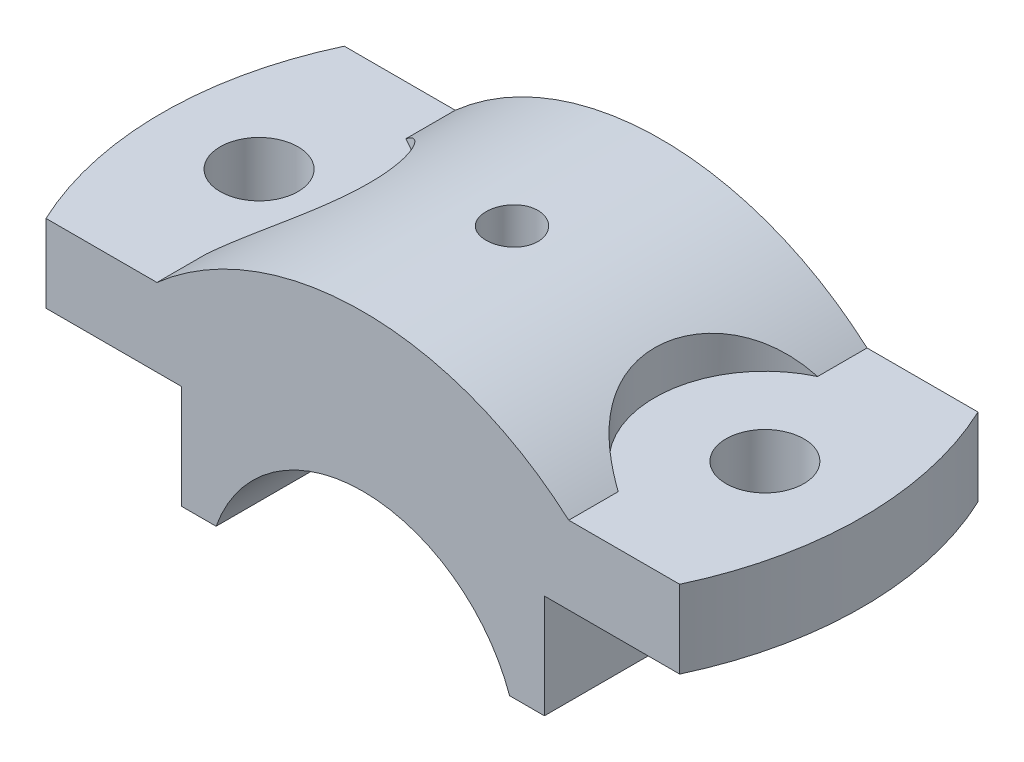
ISO-10303-21;
HEADER;
FILE_DESCRIPTION(('STEP AP214'),'2;1');
FILE_NAME('part.step','',(''),(''),'','','');
FILE_SCHEMA(('AUTOMOTIVE_DESIGN { 1 0 10303 214 1 1 1 1 }'));
ENDSEC;
DATA;
#1=APPLICATION_CONTEXT('core data for automotive mechanical design processes');
#2=APPLICATION_PROTOCOL_DEFINITION('international standard','automotive_design',2000,#1);
#3=PRODUCT_CONTEXT('',#1,'mechanical');
#4=PRODUCT('Part','Part','',(#3));
#5=PRODUCT_RELATED_PRODUCT_CATEGORY('part','',(#4));
#6=PRODUCT_DEFINITION_FORMATION('','',#4);
#7=PRODUCT_DEFINITION_CONTEXT('part definition',#1,'design');
#8=PRODUCT_DEFINITION('design','',#6,#7);
#9=PRODUCT_DEFINITION_SHAPE('','',#8);
#10=(LENGTH_UNIT() NAMED_UNIT(*) SI_UNIT(.MILLI.,.METRE.));
#11=(NAMED_UNIT(*) PLANE_ANGLE_UNIT() SI_UNIT($,.RADIAN.));
#12=(NAMED_UNIT(*) SI_UNIT($,.STERADIAN.) SOLID_ANGLE_UNIT());
#13=UNCERTAINTY_MEASURE_WITH_UNIT(LENGTH_MEASURE(1.E-05),#10,'distance_accuracy_value','');
#14=(GEOMETRIC_REPRESENTATION_CONTEXT(3) GLOBAL_UNCERTAINTY_ASSIGNED_CONTEXT((#13)) GLOBAL_UNIT_ASSIGNED_CONTEXT((#10,
#11,#12)) REPRESENTATION_CONTEXT('',''));
#15=CARTESIAN_POINT('',(0.,0.,0.));
#16=DIRECTION('',(0.,0.,1.));
#17=DIRECTION('',(1.,0.,0.));
#18=AXIS2_PLACEMENT_3D('',#15,#16,#17);
#19=CARTESIAN_POINT('',(0.,0.,23.));
#20=DIRECTION('',(0.,0.,-1.));
#21=DIRECTION('',(-1.,0.,0.));
#22=AXIS2_PLACEMENT_3D('',#19,#20,#21);
#23=CYLINDRICAL_SURFACE('',#22,48.);
#24=CARTESIAN_POINT('',(0.,48.,4.));
#25=CARTESIAN_POINT('',(-0.224264359684817,47.9999978164606,3.99999020469488));
#26=CARTESIAN_POINT('',(-0.448681388720903,47.9984115417359,3.98107612075582));
#27=CARTESIAN_POINT('',(-0.891306282801559,47.99223609313,3.90590259257969));
#28=CARTESIAN_POINT('',(-1.10950682090092,47.9876435172678,3.84960083878039));
#29=CARTESIAN_POINT('',(-1.53322409005704,47.9759744498441,3.70129138476253));
#30=CARTESIAN_POINT('',(-1.73874792169846,47.9688993639394,3.60930388756073));
#31=CARTESIAN_POINT('',(-2.13138893366431,47.9530587097885,3.39227027251202));
#32=CARTESIAN_POINT('',(-2.31851003954155,47.9442935032543,3.26723122608997));
#33=CARTESIAN_POINT('',(-2.66955999986236,47.9260311946685,2.98729973357602));
#34=CARTESIAN_POINT('',(-2.83343548966464,47.916532483463,2.83234046425726));
#35=CARTESIAN_POINT('',(-3.13288453414622,47.8978872321267,2.49710841660027));
#36=CARTESIAN_POINT('',(-3.26845684548602,47.8887407074816,2.31683452678951));
#37=CARTESIAN_POINT('',(-3.50763168956091,47.8718181064497,1.93576753160389));
#38=CARTESIAN_POINT('',(-3.61118733180617,47.8640440472037,1.73494489838891));
#39=CARTESIAN_POINT('',(-3.78308973509538,47.8507649779309,1.31868681777607));
#40=CARTESIAN_POINT('',(-3.85143711804967,47.8452599278253,1.103251628567));
#41=CARTESIAN_POINT('',(-3.95082811927428,47.8371556826529,0.66441843247529));
#42=CARTESIAN_POINT('',(-3.9819586615591,47.8345497174488,0.441040240029592));
#43=CARTESIAN_POINT('',(-4.00630083206171,47.832517292859,-0.00778481578146269));
#44=CARTESIAN_POINT('',(-3.99951317191816,47.8330907738024,-0.23323164024401));
#45=CARTESIAN_POINT('',(-3.94828345685939,47.8373462944655,-0.679198662042085));
#46=CARTESIAN_POINT('',(-3.90393587215223,47.8410205351141,-0.89972979630565));
#47=CARTESIAN_POINT('',(-3.77899194153176,47.8510513427746,-1.33020746957181));
#48=CARTESIAN_POINT('',(-3.69839524158714,47.857407935984,-1.54015390517541));
#49=CARTESIAN_POINT('',(-3.50313515260813,47.8720961882741,-1.94380362351239));
#50=CARTESIAN_POINT('',(-3.38842937902877,47.8804303020385,-2.13748631035003));
#51=CARTESIAN_POINT('',(-3.12823777565339,47.8981322745552,-2.50288535527922));
#52=CARTESIAN_POINT('',(-2.98275132249017,47.9075001542412,-2.67460126838886));
#53=CARTESIAN_POINT('',(-2.66459832890545,47.9262488164658,-2.99174167712626));
#54=CARTESIAN_POINT('',(-2.4918501175623,47.9356295510026,-3.13708425651701));
#55=CARTESIAN_POINT('',(-2.124362225487,47.9533196747934,-3.39671889355421));
#56=CARTESIAN_POINT('',(-1.92962253006135,47.9616290633314,-3.51101093045423));
#57=CARTESIAN_POINT('',(-1.5236263730714,47.9762418323856,-3.70529505067482));
#58=CARTESIAN_POINT('',(-1.3123681672363,47.9825450006977,-3.78528350591262));
#59=CARTESIAN_POINT('',(-0.879356276078327,47.9924326964719,-3.90863252980531));
#60=CARTESIAN_POINT('',(-0.65760280867542,47.9960172803554,-3.95199385862105));
#61=CARTESIAN_POINT('',(-0.210605200657004,48.000056677722,-4.00075505616631));
#62=CARTESIAN_POINT('',(0.0146265164607834,48.0005208196801,-4.00626807242759));
#63=CARTESIAN_POINT('',(0.462811010013213,47.998291951148,-3.97947255749074));
#64=CARTESIAN_POINT('',(0.685763807685652,47.995598970107,-3.94716437908216));
#65=CARTESIAN_POINT('',(1.1227390248988,47.9873647136528,-3.84573736555962));
#66=CARTESIAN_POINT('',(1.33677370055889,47.9818274966968,-3.77667097589676));
#67=CARTESIAN_POINT('',(1.75021666032996,47.968526804494,-3.60374164887188));
#68=CARTESIAN_POINT('',(1.94962471313253,47.9607632940497,-3.499878161366));
#69=CARTESIAN_POINT('',(2.32866887320763,47.9438570557453,-3.26001860313458));
#70=CARTESIAN_POINT('',(2.50825740208588,47.9347111287495,-3.12394757442069));
#71=CARTESIAN_POINT('',(2.84208437937448,47.9160783455879,-2.82364377179807));
#72=CARTESIAN_POINT('',(2.99632238725753,47.9065914835011,-2.65941050860293));
#73=CARTESIAN_POINT('',(3.27545818182041,47.8883184486329,-2.30695323120664));
#74=CARTESIAN_POINT('',(3.40028213293455,47.8795340749689,-2.1186706352104));
#75=CARTESIAN_POINT('',(3.61654025135807,47.8636860697728,-1.72375094854634));
#76=CARTESIAN_POINT('',(3.70797475203985,47.8566224210606,-1.51711404116025));
#77=CARTESIAN_POINT('',(3.85473270976226,47.8450257139576,-1.09161283784305));
#78=CARTESIAN_POINT('',(3.91010136579716,47.8404894891454,-0.872764221142678));
#79=CARTESIAN_POINT('',(3.98330307964061,47.834450627634,-0.428837200502305));
#80=CARTESIAN_POINT('',(4.00113685827306,47.8329479326787,-0.203758916281622));
#81=CARTESIAN_POINT('',(3.99875425156372,47.8331471180078,0.245504504083582));
#82=CARTESIAN_POINT('',(3.97865387910956,47.8348392277228,0.469690268945752));
#83=CARTESIAN_POINT('',(3.90121545318012,47.8412166032922,0.911490134203405));
#84=CARTESIAN_POINT('',(3.84387734291051,47.8459018737118,1.12910422457536));
#85=CARTESIAN_POINT('',(3.69362044006825,47.8577350852682,1.55159105306647));
#86=CARTESIAN_POINT('',(3.60070373602613,47.8648828818476,1.75646453826275));
#87=CARTESIAN_POINT('',(3.381940235789,47.8808359950028,2.14772336229467));
#88=CARTESIAN_POINT('',(3.25609395645823,47.8896412855619,2.3341089912533));
#89=CARTESIAN_POINT('',(2.97460776848979,47.9079492679472,2.68369495605204));
#90=CARTESIAN_POINT('',(2.81888197496583,47.9174539202297,2.84682603462939));
#91=CARTESIAN_POINT('',(2.48221290236986,47.9360718003871,3.14470074081328));
#92=CARTESIAN_POINT('',(2.30126353056437,47.945184932993,3.27943748998406));
#93=CARTESIAN_POINT('',(1.91893509211766,47.962009393691,3.51687944167025));
#94=CARTESIAN_POINT('',(1.71751862508215,47.9697180809242,3.61952455462531));
#95=CARTESIAN_POINT('',(1.30038300798293,47.982834100652,3.78940721220511));
#96=CARTESIAN_POINT('',(1.0846806216546,47.9882440771302,3.85668545715242));
#97=CARTESIAN_POINT('',(0.723088192386717,47.994764309354,3.93679033000819));
#98=CARTESIAN_POINT('',(0.579523577753882,47.9967187550781,3.96046245006995));
#99=CARTESIAN_POINT('',(0.290660686004649,47.9993373063453,3.99207043870882));
#100=CARTESIAN_POINT('',(0.14536241349218,48.0000014153143,4.00000634906587));
#101=CARTESIAN_POINT('',(0.,48.,4.));
#102=B_SPLINE_CURVE_WITH_KNOTS('',3,(#24,#25,#26,#27,#28,#29,#30,#31,#32,#33,#34,#35,#36,#37,
#38,#39,#40,#41,#42,#43,#44,#45,#46,#47,#48,#49,#50,#51,#52,#53,#54,#55,#56,#57,#58,#59,#60,#61,
#62,#63,#64,#65,#66,#67,#68,#69,#70,#71,#72,#73,#74,#75,#76,#77,#78,#79,#80,#81,#82,#83,#84,#85,
#86,#87,#88,#89,#90,#91,#92,#93,#94,#95,#96,#97,#98,#99,#100,#101),.UNSPECIFIED.,.T.,.F.,(4,2,2,
2,2,2,2,2,2,2,2,2,2,2,2,2,2,2,2,2,2,2,2,2,2,2,2,2,2,2,2,2,2,2,2,2,2,2,4),(0.,0.672262347200556,
1.34528675599134,2.01793069555582,2.69043083833672,3.36445067514306,4.03850011495726,
4.71353211804365,5.38855219711603,6.06199259326345,6.73542035050475,7.40715932441158,
8.07890485907995,8.75148862995597,9.42408602323441,10.098738037406,10.7733905023458,
11.448114303618,12.1228241013014,12.7955159722867,13.4682015685688,14.1399299612314,
14.8116689744549,15.4849869989971,16.15831672285,16.8333190596481,17.5083146567931,
18.1824626896371,18.8565977759503,19.5286745153011,20.2007522796936,20.8727905979009,
21.5448183683942,22.2188075465856,22.8929598092992,23.5683669225022,24.2429950636714,
24.6787394542665,25.1144826879498),.UNSPECIFIED.);
#103=CARTESIAN_POINT('',(0.,48.,4.));
#104=VERTEX_POINT('',#103);
#105=EDGE_CURVE('E11',#104,#104,#102,.T.);
#106=ORIENTED_EDGE('',*,*,#105,.T.);
#107=EDGE_LOOP('',(#106));
#108=FACE_BOUND('',#107,.T.);
#109=DIRECTION('',(0.,0.,-1.));
#110=VECTOR('',#109,1.);
#111=CARTESIAN_POINT('',(-31.7490157327748,36.0000000000003,23.));
#112=LINE('',#111,#110);
#113=CARTESIAN_POINT('',(-31.7490157327748,36.0000000000003,-15.3760601961769));
#114=VERTEX_POINT('',#113);
#115=CARTESIAN_POINT('',(-31.7490157327751,36.,-23.));
#116=VERTEX_POINT('',#115);
#117=EDGE_CURVE('E150',#114,#116,#112,.T.);
#118=ORIENTED_EDGE('',*,*,#117,.F.);
#119=CARTESIAN_POINT('',(-31.7490157327751,36.,-15.3760601961769));
#120=CARTESIAN_POINT('',(-31.5666993606048,36.1607910344816,-15.2900831270757));
#121=CARTESIAN_POINT('',(-31.3842407385663,36.3192382806886,-15.200076432177));
#122=CARTESIAN_POINT('',(-31.0194382984914,36.6312986785064,-15.0117552307289));
#123=CARTESIAN_POINT('',(-30.8370944958099,36.7849112802083,-14.9134397837671));
#124=CARTESIAN_POINT('',(-30.2906545114744,37.2384242405059,-14.6055515958542));
#125=CARTESIAN_POINT('',(-29.9273932433292,37.5307855559239,-14.3831506648985));
#126=CARTESIAN_POINT('',(-29.2055877678829,38.0952057641667,-13.9017498917579));
#127=CARTESIAN_POINT('',(-28.8470773519233,38.3671527207169,-13.6425680163447));
#128=CARTESIAN_POINT('',(-28.1414563178619,38.8876660950044,-13.0879067788259));
#129=CARTESIAN_POINT('',(-27.7943424142725,39.1362392903486,-12.7924379963692));
#130=CARTESIAN_POINT('',(-27.1144372728569,39.6103537782901,-12.1634340928703));
#131=CARTESIAN_POINT('',(-26.7817440960143,39.8357484531289,-11.8296819039897));
#132=CARTESIAN_POINT('',(-26.1381758530123,40.2609560521935,-11.1265718110928));
#133=CARTESIAN_POINT('',(-25.8273031949563,40.4607661549158,-10.7572099878546));
#134=CARTESIAN_POINT('',(-25.2335249148575,40.8337098769773,-9.98600624775));
#135=CARTESIAN_POINT('',(-24.9505424988563,41.0069175240425,-9.58425938846312));
#136=CARTESIAN_POINT('',(-24.4165226257608,41.3271148139075,-8.75027197863381));
#137=CARTESIAN_POINT('',(-24.165480267083,41.4741084809499,-8.31803612285603));
#138=CARTESIAN_POINT('',(-23.7269538102758,41.7263466257883,-7.47873214327821));
#139=CARTESIAN_POINT('',(-23.535471816767,41.8344606926746,-7.07460691096143));
#140=CARTESIAN_POINT('',(-23.1835604410674,42.0305023424913,-6.24834535649117));
#141=CARTESIAN_POINT('',(-23.0231288276401,42.1184313759742,-5.82621033115845));
#142=CARTESIAN_POINT('',(-22.7354708993115,42.2744033380662,-4.9669406692712));
#143=CARTESIAN_POINT('',(-22.608263014144,42.3424352319097,-4.52979785912656));
#144=CARTESIAN_POINT('',(-22.3889311500727,42.4588178093571,-3.64423461983452));
#145=CARTESIAN_POINT('',(-22.2968060905276,42.5071690991774,-3.19581453850973));
#146=CARTESIAN_POINT('',(-22.1535573681311,42.5819913104556,-2.31986442510465));
#147=CARTESIAN_POINT('',(-22.1002179585565,42.6096478774008,-1.8927960452594));
#148=CARTESIAN_POINT('',(-22.0260840023336,42.6480173220226,-1.0351010084908));
#149=CARTESIAN_POINT('',(-22.0052877863416,42.6587310688026,-0.604474535223505));
#150=CARTESIAN_POINT('',(-21.9964874817101,42.6632694542849,0.257033751988564));
#151=CARTESIAN_POINT('',(-22.0084707600267,42.6571005994522,0.687915403597725));
#152=CARTESIAN_POINT('',(-22.065059537599,42.6278566152432,1.5469567479689));
#153=CARTESIAN_POINT('',(-22.1096651361626,42.6047814344012,1.97511643244078));
#154=CARTESIAN_POINT('',(-22.2301596888934,42.5420325739506,2.81994764060091));
#155=CARTESIAN_POINT('',(-22.3056259308811,42.5025830752487,3.23669621522389));
#156=CARTESIAN_POINT('',(-22.4869158657054,42.4069464217796,4.06157204983066));
#157=CARTESIAN_POINT('',(-22.5927390819871,42.3507595297616,4.46969944504493));
#158=CARTESIAN_POINT('',(-22.8334963082055,42.2214412118201,5.27452238868222));
#159=CARTESIAN_POINT('',(-22.968430619134,42.1483096106976,5.67121781885726));
#160=CARTESIAN_POINT('',(-23.2658059297839,41.9848905587104,6.45050946606148));
#161=CARTESIAN_POINT('',(-23.4282471429062,41.8946029747475,6.83310557367883));
#162=CARTESIAN_POINT('',(-23.7802108235912,41.6958360657888,7.58497168737197));
#163=CARTESIAN_POINT('',(-23.9699550727257,41.5872063549857,7.95409805630049));
#164=CARTESIAN_POINT('',(-24.3731485080022,41.3521952355227,8.67324372694056));
#165=CARTESIAN_POINT('',(-24.5865977528721,41.2258137828835,9.02326298131199));
#166=CARTESIAN_POINT('',(-25.0346129932482,40.9552998874379,9.70223622389593));
#167=CARTESIAN_POINT('',(-25.2691774101921,40.8111687712936,10.031191783681));
#168=CARTESIAN_POINT('',(-25.7566603032743,40.5052741270816,10.6665029899036));
#169=CARTESIAN_POINT('',(-26.0095789285025,40.3435104557808,10.9728584527217));
#170=CARTESIAN_POINT('',(-26.5418842805158,39.9954208539864,11.574253346598));
#171=CARTESIAN_POINT('',(-26.8219376643438,39.8083462352715,11.8682688661706));
#172=CARTESIAN_POINT('',(-27.3955194624364,39.4158125971757,12.42968690155));
#173=CARTESIAN_POINT('',(-27.6890490642933,39.2103519560056,12.6970870652738));
#174=CARTESIAN_POINT('',(-28.2863824379904,38.7816416595243,13.2050051767951));
#175=CARTESIAN_POINT('',(-28.5901897214681,38.5583858879776,13.4455138130625));
#176=CARTESIAN_POINT('',(-29.2047776474053,38.0950011657592,13.8996257253554));
#177=CARTESIAN_POINT('',(-29.515556781803,37.8548758405909,14.113234755093));
#178=CARTESIAN_POINT('',(-30.1465409740783,37.3543930550497,14.5175420543304));
#179=CARTESIAN_POINT('',(-30.4668164417767,37.0937608790559,14.7077886938376));
#180=CARTESIAN_POINT('',(-31.1079315091614,36.5577863535064,15.0615091701432));
#181=CARTESIAN_POINT('',(-31.4287665224091,36.282490555825,15.2250617322872));
#182=CARTESIAN_POINT('',(-31.7490157327751,36.,15.3760601961769));
#183=B_SPLINE_CURVE_WITH_KNOTS('',3,(#119,#120,#121,#122,#123,#124,#125,#126,#127,#128,#129,
#130,#131,#132,#133,#134,#135,#136,#137,#138,#139,#140,#141,#142,#143,#144,#145,#146,#147,#148,
#149,#150,#151,#152,#153,#154,#155,#156,#157,#158,#159,#160,#161,#162,#163,#164,#165,#166,#167,
#168,#169,#170,#171,#172,#173,#174,#175,#176,#177,#178,#179,#180,#181,#182),.UNSPECIFIED.,.F.,
.F.,(4,2,2,2,2,2,2,2,2,2,2,2,2,2,2,2,2,2,2,2,2,2,2,2,2,2,2,2,2,2,2,4),(0.,0.773458025682374,
1.5470037114875,3.09512332277502,4.65119082007947,6.20680570955183,7.77172305062613,
9.33681282467526,10.8974652129592,12.4578778108563,13.8363264835486,15.2146760660573,
16.5937886249588,17.9728587002061,19.2651269606078,20.5573289303254,21.8490329624021,
23.1407409266611,24.4153187748838,25.6898766154092,26.9644476347566,28.2390285427914,
29.5246179289053,30.8102105000725,32.0957070405173,33.381214024115,34.7209972321288,
36.060898736084,37.4012627703214,38.7413396176214,40.1042161588979,41.4629977344695),.UNSPECIFIED.);
#184=CARTESIAN_POINT('',(-31.7490157327751,36.,15.3760601961769));
#185=VERTEX_POINT('',#184);
#186=EDGE_CURVE('E142',#114,#185,#183,.T.);
#187=ORIENTED_EDGE('',*,*,#186,.T.);
#188=CARTESIAN_POINT('',(-31.7490157327748,36.0000000000003,23.));
#189=VERTEX_POINT('',#188);
#190=EDGE_CURVE('E147',#189,#185,#112,.T.);
#191=ORIENTED_EDGE('',*,*,#190,.F.);
#192=CARTESIAN_POINT('',(0.,0.,23.));
#193=DIRECTION('',(0.,0.,1.));
#194=DIRECTION('',(1.,0.,0.));
#195=AXIS2_PLACEMENT_3D('',#192,#193,#194);
#196=CIRCLE('',#195,48.);
#197=CARTESIAN_POINT('',(31.7490157327751,36.,23.));
#198=VERTEX_POINT('',#197);
#199=EDGE_CURVE('E500',#198,#189,#196,.T.);
#200=ORIENTED_EDGE('',*,*,#199,.F.);
#201=DIRECTION('',(0.,0.,-1.));
#202=VECTOR('',#201,1.);
#203=CARTESIAN_POINT('',(31.7490157327751,36.,23.));
#204=LINE('',#203,#202);
#205=CARTESIAN_POINT('',(31.7490157327751,36.,15.3760601961769));
#206=VERTEX_POINT('',#205);
#207=EDGE_CURVE('E158',#198,#206,#204,.T.);
#208=ORIENTED_EDGE('',*,*,#207,.T.);
#209=CARTESIAN_POINT('',(31.7490157327751,36.,-15.3760601961769));
#210=CARTESIAN_POINT('',(31.5666993606048,36.1607910344816,-15.2900831270757));
#211=CARTESIAN_POINT('',(31.3842407385663,36.3192382806886,-15.200076432177));
#212=CARTESIAN_POINT('',(31.0194382984914,36.6312986785064,-15.0117552307289));
#213=CARTESIAN_POINT('',(30.8370944958099,36.7849112802083,-14.9134397837671));
#214=CARTESIAN_POINT('',(30.2906545114744,37.2384242405059,-14.6055515958542));
#215=CARTESIAN_POINT('',(29.9273932433292,37.5307855559239,-14.3831506648985));
#216=CARTESIAN_POINT('',(29.2055877678829,38.0952057641667,-13.9017498917579));
#217=CARTESIAN_POINT('',(28.8470773519233,38.3671527207169,-13.6425680163447));
#218=CARTESIAN_POINT('',(28.1414563178619,38.8876660950044,-13.0879067788259));
#219=CARTESIAN_POINT('',(27.7943424142725,39.1362392903486,-12.7924379963692));
#220=CARTESIAN_POINT('',(27.1144372728569,39.6103537782901,-12.1634340928703));
#221=CARTESIAN_POINT('',(26.7817440960143,39.8357484531289,-11.8296819039897));
#222=CARTESIAN_POINT('',(26.1381758530123,40.2609560521935,-11.1265718110928));
#223=CARTESIAN_POINT('',(25.8273031949563,40.4607661549158,-10.7572099878546));
#224=CARTESIAN_POINT('',(25.2335249148575,40.8337098769773,-9.98600624775));
#225=CARTESIAN_POINT('',(24.9505424988563,41.0069175240425,-9.58425938846312));
#226=CARTESIAN_POINT('',(24.4165226257608,41.3271148139075,-8.75027197863381));
#227=CARTESIAN_POINT('',(24.165480267083,41.4741084809499,-8.31803612285603));
#228=CARTESIAN_POINT('',(23.7269538102758,41.7263466257883,-7.47873214327821));
#229=CARTESIAN_POINT('',(23.535471816767,41.8344606926746,-7.07460691096143));
#230=CARTESIAN_POINT('',(23.1835604410674,42.0305023424913,-6.24834535649117));
#231=CARTESIAN_POINT('',(23.0231288276401,42.1184313759742,-5.82621033115845));
#232=CARTESIAN_POINT('',(22.7354708993115,42.2744033380662,-4.9669406692712));
#233=CARTESIAN_POINT('',(22.608263014144,42.3424352319097,-4.52979785912656));
#234=CARTESIAN_POINT('',(22.3889311500727,42.4588178093571,-3.64423461983452));
#235=CARTESIAN_POINT('',(22.2968060905276,42.5071690991774,-3.19581453850973));
#236=CARTESIAN_POINT('',(22.1535573681311,42.5819913104556,-2.31986442510465));
#237=CARTESIAN_POINT('',(22.1002179585565,42.6096478774008,-1.8927960452594));
#238=CARTESIAN_POINT('',(22.0260840023336,42.6480173220226,-1.0351010084908));
#239=CARTESIAN_POINT('',(22.0052877863416,42.6587310688026,-0.604474535223505));
#240=CARTESIAN_POINT('',(21.9964874817101,42.6632694542849,0.257033751988564));
#241=CARTESIAN_POINT('',(22.0084707600267,42.6571005994522,0.687915403597725));
#242=CARTESIAN_POINT('',(22.065059537599,42.6278566152432,1.5469567479689));
#243=CARTESIAN_POINT('',(22.1096651361626,42.6047814344012,1.97511643244078));
#244=CARTESIAN_POINT('',(22.2301596888934,42.5420325739506,2.81994764060091));
#245=CARTESIAN_POINT('',(22.3056259308811,42.5025830752487,3.23669621522389));
#246=CARTESIAN_POINT('',(22.4869158657054,42.4069464217796,4.06157204983066));
#247=CARTESIAN_POINT('',(22.5927390819871,42.3507595297616,4.46969944504493));
#248=CARTESIAN_POINT('',(22.8334963082055,42.2214412118201,5.27452238868222));
#249=CARTESIAN_POINT('',(22.968430619134,42.1483096106976,5.67121781885726));
#250=CARTESIAN_POINT('',(23.2658059297839,41.9848905587104,6.45050946606148));
#251=CARTESIAN_POINT('',(23.4282471429062,41.8946029747475,6.83310557367883));
#252=CARTESIAN_POINT('',(23.7802108235912,41.6958360657888,7.58497168737197));
#253=CARTESIAN_POINT('',(23.9699550727257,41.5872063549857,7.95409805630049));
#254=CARTESIAN_POINT('',(24.3731485080022,41.3521952355227,8.67324372694056));
#255=CARTESIAN_POINT('',(24.5865977528721,41.2258137828835,9.02326298131199));
#256=CARTESIAN_POINT('',(25.0346129932482,40.9552998874379,9.70223622389593));
#257=CARTESIAN_POINT('',(25.2691774101921,40.8111687712936,10.031191783681));
#258=CARTESIAN_POINT('',(25.7566603032743,40.5052741270816,10.6665029899036));
#259=CARTESIAN_POINT('',(26.0095789285025,40.3435104557808,10.9728584527217));
#260=CARTESIAN_POINT('',(26.5418842805158,39.9954208539864,11.574253346598));
#261=CARTESIAN_POINT('',(26.8219376643438,39.8083462352715,11.8682688661706));
#262=CARTESIAN_POINT('',(27.3955194624364,39.4158125971757,12.42968690155));
#263=CARTESIAN_POINT('',(27.6890490642933,39.2103519560056,12.6970870652738));
#264=CARTESIAN_POINT('',(28.2863824379904,38.7816416595243,13.2050051767951));
#265=CARTESIAN_POINT('',(28.5901897214681,38.5583858879776,13.4455138130625));
#266=CARTESIAN_POINT('',(29.2047776474053,38.0950011657592,13.8996257253554));
#267=CARTESIAN_POINT('',(29.515556781803,37.8548758405909,14.113234755093));
#268=CARTESIAN_POINT('',(30.1465409740783,37.3543930550497,14.5175420543304));
#269=CARTESIAN_POINT('',(30.4668164417767,37.0937608790559,14.7077886938376));
#270=CARTESIAN_POINT('',(31.1079315091614,36.5577863535064,15.0615091701432));
#271=CARTESIAN_POINT('',(31.4287665224091,36.282490555825,15.2250617322872));
#272=CARTESIAN_POINT('',(31.7490157327751,36.,15.3760601961769));
#273=B_SPLINE_CURVE_WITH_KNOTS('',3,(#209,#210,#211,#212,#213,#214,#215,#216,#217,#218,#219,
#220,#221,#222,#223,#224,#225,#226,#227,#228,#229,#230,#231,#232,#233,#234,#235,#236,#237,#238,
#239,#240,#241,#242,#243,#244,#245,#246,#247,#248,#249,#250,#251,#252,#253,#254,#255,#256,#257,
#258,#259,#260,#261,#262,#263,#264,#265,#266,#267,#268,#269,#270,#271,#272),.UNSPECIFIED.,.F.,
.F.,(4,2,2,2,2,2,2,2,2,2,2,2,2,2,2,2,2,2,2,2,2,2,2,2,2,2,2,2,2,2,2,4),(0.,0.773458025682374,
1.5470037114875,3.09512332277502,4.65119082007947,6.20680570955183,7.77172305062613,
9.33681282467526,10.8974652129592,12.4578778108563,13.8363264835486,15.2146760660573,
16.5937886249588,17.9728587002061,19.2651269606078,20.5573289303254,21.8490329624021,
23.1407409266611,24.4153187748838,25.6898766154092,26.9644476347566,28.2390285427914,
29.5246179289053,30.8102105000725,32.0957070405173,33.381214024115,34.7209972321288,
36.060898736084,37.4012627703214,38.7413396176214,40.1042161588979,41.4629977344695),.UNSPECIFIED.);
#274=CARTESIAN_POINT('',(31.7490157327751,36.,-15.3760601961769));
#275=VERTEX_POINT('',#274);
#276=EDGE_CURVE('E243',#275,#206,#273,.T.);
#277=ORIENTED_EDGE('',*,*,#276,.F.);
#278=CARTESIAN_POINT('',(31.7490157327751,36.,-23.));
#279=VERTEX_POINT('',#278);
#280=EDGE_CURVE('E156',#275,#279,#204,.T.);
#281=ORIENTED_EDGE('',*,*,#280,.T.);
#282=CARTESIAN_POINT('',(0.,0.,-23.));
#283=DIRECTION('',(0.,0.,1.));
#284=DIRECTION('',(1.,0.,0.));
#285=AXIS2_PLACEMENT_3D('',#282,#283,#284);
#286=CIRCLE('',#285,48.);
#287=EDGE_CURVE('E465',#279,#116,#286,.T.);
#288=ORIENTED_EDGE('',*,*,#287,.T.);
#289=EDGE_LOOP('',(#118,#187,#191,#200,#208,#277,#281,#288));
#290=FACE_BOUND('',#289,.T.);
#291=ADVANCED_FACE('F35',(#108,#290),#23,.T.);
#292=CARTESIAN_POINT('',(0.,8.,0.));
#293=DIRECTION('',(0.,1.,0.));
#294=DIRECTION('',(0.,0.,1.));
#295=AXIS2_PLACEMENT_3D('',#292,#293,#294);
#296=CYLINDRICAL_SURFACE('',#295,3.);
#297=CARTESIAN_POINT('',(0.,24.,3.));
#298=CARTESIAN_POINT('',(-0.167809314666914,23.9999976587571,2.99999287087714));
#299=CARTESIAN_POINT('',(-0.335723489163297,23.9982214146588,2.98587254499686));
#300=CARTESIAN_POINT('',(-0.666879362507703,23.9913064813363,2.92976669451505));
#301=CARTESIAN_POINT('',(-0.830115996748494,23.9861642812972,2.88775207449193));
#302=CARTESIAN_POINT('',(-1.14707468977566,23.9730967325329,2.7771148273031));
#303=CARTESIAN_POINT('',(-1.30080307217537,23.9651732574665,2.70851010982817));
#304=CARTESIAN_POINT('',(-1.59453536987164,23.9474244105372,2.54667925923625));
#305=CARTESIAN_POINT('',(-1.73454163386764,23.9375993650094,2.45345734976314));
#306=CARTESIAN_POINT('',(-1.99765538031758,23.9170838556759,2.24448966019249));
#307=CARTESIAN_POINT('',(-2.12067643792455,23.906389376309,2.12863544478451));
#308=CARTESIAN_POINT('',(-2.34558335226899,23.885372712117,1.87792461175603));
#309=CARTESIAN_POINT('',(-2.4474681316707,23.8750505462912,1.7430670261041));
#310=CARTESIAN_POINT('',(-2.62753219354073,23.855907667435,1.4576160269212));
#311=CARTESIAN_POINT('',(-2.70563051512929,23.8470921261349,1.30697116611847));
#312=CARTESIAN_POINT('',(-2.83538769189014,23.8320135414922,0.994575537663168));
#313=CARTESIAN_POINT('',(-2.88704754967826,23.8257504013576,0.832825191423583));
#314=CARTESIAN_POINT('',(-2.96219877602972,23.8165240752434,0.503706965295881));
#315=CARTESIAN_POINT('',(-2.98583605767804,23.8135438012409,0.336372890754967));
#316=CARTESIAN_POINT('',(-3.00472265946868,23.8111683377135,8.84838338001761E-05));
#317=CARTESIAN_POINT('',(-2.9999731212029,23.8117730040181,-0.168861783277549));
#318=CARTESIAN_POINT('',(-2.96234068373748,23.816483464437,-0.502565792698538));
#319=CARTESIAN_POINT('',(-2.92961851558164,23.8205692555239,-0.667337983440316));
#320=CARTESIAN_POINT('',(-2.83722045981846,23.8317503970915,-0.989034025462784));
#321=CARTESIAN_POINT('',(-2.77754402610228,23.8388458085487,-1.14595771765685));
#322=CARTESIAN_POINT('',(-2.63275867189398,23.8552693903758,-1.44800159882602));
#323=CARTESIAN_POINT('',(-2.54757990444916,23.8646036785373,-1.59308796029878));
#324=CARTESIAN_POINT('',(-2.3542577633483,23.8844485371672,-1.8669680332959));
#325=CARTESIAN_POINT('',(-2.24611333929693,23.894959161428,-1.99576099916842));
#326=CARTESIAN_POINT('',(-2.00903893290454,23.9160613186851,-2.23433125286729));
#327=CARTESIAN_POINT('',(-1.87997040940802,23.9266529086427,-2.34397091011918));
#328=CARTESIAN_POINT('',(-1.60518860293671,23.9466555906702,-2.54005065603666));
#329=CARTESIAN_POINT('',(-1.4594752815819,23.9560666800181,-2.6264906912064));
#330=CARTESIAN_POINT('',(-1.15543400563618,23.972653826623,-2.7737175845567));
#331=CARTESIAN_POINT('',(-0.997101834405262,23.9798291328184,-2.83449582465747));
#332=CARTESIAN_POINT('',(-0.672369528517269,23.9911294293607,-2.9285645922279));
#333=CARTESIAN_POINT('',(-0.505969771956802,23.9952545625104,-2.96185640656446));
#334=CARTESIAN_POINT('',(-0.171015796696198,23.9999711569291,-2.99982890911266));
#335=CARTESIAN_POINT('',(-0.00248338823833038,24.0005860337116,-3.00469919083688));
#336=CARTESIAN_POINT('',(0.332995243796994,23.9982760560652,-2.98619071913286));
#337=CARTESIAN_POINT('',(0.499941501077646,23.9953512770186,-2.96281256729809));
#338=CARTESIAN_POINT('',(0.826949409265825,23.9863052250803,-2.88862834947074));
#339=CARTESIAN_POINT('',(0.987031884509645,23.9801944897664,-2.83791268391684));
#340=CARTESIAN_POINT('',(1.29641958583009,23.9654606772024,-2.7105870577045));
#341=CARTESIAN_POINT('',(1.44572444575838,23.9568375146475,-2.63397621781029));
#342=CARTESIAN_POINT('',(1.73016542482491,23.9379818749213,-2.45657623499105));
#343=CARTESIAN_POINT('',(1.86522451193258,23.9277413285101,-2.35566445223324));
#344=CARTESIAN_POINT('',(2.11655638755158,23.9068217079079,-2.13270060295896));
#345=CARTESIAN_POINT('',(2.23282843000423,23.8961426163228,-2.01064769729881));
#346=CARTESIAN_POINT('',(2.44395835058162,23.875477265551,-1.74803109989143));
#347=CARTESIAN_POINT('',(2.53869055268152,23.8654952966559,-1.60736598442753));
#348=CARTESIAN_POINT('',(2.70318346733221,23.8474249324458,-1.31201010617435));
#349=CARTESIAN_POINT('',(2.77294468047404,23.8393364991723,-1.15731962462818));
#350=CARTESIAN_POINT('',(2.88531189463985,23.8259982047159,-0.838709617022865));
#351=CARTESIAN_POINT('',(2.92798875294853,23.8207409422175,-0.674815403942435));
#352=CARTESIAN_POINT('',(2.98520399264142,23.8136389908895,-0.342117019463202));
#353=CARTESIAN_POINT('',(2.99974368304292,23.8117941433053,-0.173313076849199));
#354=CARTESIAN_POINT('',(3.0002478433018,23.8117305237895,0.163162715045613));
#355=CARTESIAN_POINT('',(2.98640975723913,23.8134866970234,0.330834297998265));
#356=CARTESIAN_POINT('',(2.93096928581919,23.8203733744464,0.661448555214093));
#357=CARTESIAN_POINT('',(2.88936689748692,23.825503878997,0.824391228970554));
#358=CARTESIAN_POINT('',(2.77964048842759,23.8385533892946,1.14089634811968));
#359=CARTESIAN_POINT('',(2.71152597716512,23.8464713951134,1.29446213402618));
#360=CARTESIAN_POINT('',(2.55072828258037,23.8642053989378,1.58801598485798));
#361=CARTESIAN_POINT('',(2.45804479141151,23.874021420725,1.72800387962379));
#362=CARTESIAN_POINT('',(2.25000759751901,23.8945272570268,1.99143747040857));
#363=CARTESIAN_POINT('',(2.13450675092995,23.9052224650084,2.11476655314597));
#364=CARTESIAN_POINT('',(1.88442027236206,23.9262339791148,2.34036819020157));
#365=CARTESIAN_POINT('',(1.74983014696988,23.9365501953071,2.44263577292917));
#366=CARTESIAN_POINT('',(1.46479874502505,23.955684679041,2.62354242852635));
#367=CARTESIAN_POINT('',(1.3142991355154,23.9644971009396,2.70209016707911));
#368=CARTESIAN_POINT('',(1.00221948276154,23.9795717889207,2.83268549149954));
#369=CARTESIAN_POINT('',(0.840651697044284,23.9858368244349,2.88476187162415));
#370=CARTESIAN_POINT('',(0.56520692636151,23.993600643933,2.94847120580557));
#371=CARTESIAN_POINT('',(0.453066796220305,23.9959887107454,2.96776673037848));
#372=CARTESIAN_POINT('',(0.227300475854922,23.9991891759503,2.99353349483187));
#373=CARTESIAN_POINT('',(0.113674296595233,24.0000015859616,3.00000482927916));
#374=CARTESIAN_POINT('',(0.,24.,3.));
#375=B_SPLINE_CURVE_WITH_KNOTS('',3,(#297,#298,#299,#300,#301,#302,#303,#304,#305,#306,#307,
#308,#309,#310,#311,#312,#313,#314,#315,#316,#317,#318,#319,#320,#321,#322,#323,#324,#325,#326,
#327,#328,#329,#330,#331,#332,#333,#334,#335,#336,#337,#338,#339,#340,#341,#342,#343,#344,#345,
#346,#347,#348,#349,#350,#351,#352,#353,#354,#355,#356,#357,#358,#359,#360,#361,#362,#363,#364,
#365,#366,#367,#368,#369,#370,#371,#372,#373,#374),.UNSPECIFIED.,.T.,.F.,(4,2,2,2,2,2,2,2,2,2,2,
2,2,2,2,2,2,2,2,2,2,2,2,2,2,2,2,2,2,2,2,2,2,2,2,2,2,2,4),(0.,0.503012727331497,1.00655095313211,
1.50975060981812,2.01286398709288,2.51844975842212,3.02406129360013,3.53137500382643,
4.03866947396168,4.54331070343585,5.04793163861596,5.5496723573003,6.0514232419949,
6.5545611154264,7.05772200616366,7.564361737637,8.07100263735736,8.57781354877926,
9.08460073084536,9.58800335270305,10.0913952540231,10.5931326467208,11.0948870769474,
11.5992288351411,12.1035906165011,12.6108236580909,13.1180465306585,13.6239368913711,
14.1298037161275,14.6321628144266,15.1345219665546,15.6367010964779,16.1388865189472,
16.644422852302,17.1500783816402,17.6576568364422,18.1646819842084,18.5054261182515,
18.8461677396052),.UNSPECIFIED.);
#376=CARTESIAN_POINT('',(0.,24.,3.));
#377=VERTEX_POINT('',#376);
#378=EDGE_CURVE('E171',#377,#377,#375,.T.);
#379=ORIENTED_EDGE('',*,*,#378,.T.);
#380=EDGE_LOOP('',(#379));
#381=FACE_BOUND('',#380,.T.);
#382=CARTESIAN_POINT('',(0.,32.,0.));
#383=DIRECTION('',(0.,1.,0.));
#384=DIRECTION('',(0.,0.,1.));
#385=AXIS2_PLACEMENT_3D('',#382,#383,#384);
#386=CIRCLE('',#385,3.);
#387=CARTESIAN_POINT('',(0.,32.,3.));
#388=VERTEX_POINT('',#387);
#389=EDGE_CURVE('E169',#388,#388,#386,.F.);
#390=ORIENTED_EDGE('',*,*,#389,.F.);
#391=EDGE_LOOP('',(#390));
#392=FACE_BOUND('',#391,.T.);
#393=ADVANCED_FACE('F192',(#381,#392),#296,.F.);
#394=CARTESIAN_POINT('',(0.,0.,23.));
#395=DIRECTION('',(0.,0.,-1.));
#396=DIRECTION('',(-1.,0.,0.));
#397=AXIS2_PLACEMENT_3D('',#394,#395,#396);
#398=CYLINDRICAL_SURFACE('',#397,24.);
#399=ORIENTED_EDGE('',*,*,#378,.F.);
#400=EDGE_LOOP('',(#399));
#401=FACE_BOUND('',#400,.T.);
#402=CARTESIAN_POINT('',(0.,0.,-23.));
#403=DIRECTION('',(0.,0.,1.));
#404=DIRECTION('',(1.,0.,0.));
#405=AXIS2_PLACEMENT_3D('',#402,#403,#404);
#406=CIRCLE('',#405,24.);
#407=CARTESIAN_POINT('',(22.6274169979695,8.,-23.));
#408=VERTEX_POINT('',#407);
#409=CARTESIAN_POINT('',(-22.6274169979695,8.,-23.));
#410=VERTEX_POINT('',#409);
#411=EDGE_CURVE('E443',#408,#410,#406,.T.);
#412=ORIENTED_EDGE('',*,*,#411,.F.);
#413=DIRECTION('',(0.,0.,-1.));
#414=VECTOR('',#413,1.);
#415=CARTESIAN_POINT('',(22.6274169979695,8.,23.));
#416=LINE('',#415,#414);
#417=CARTESIAN_POINT('',(22.6274169979695,8.,23.));
#418=VERTEX_POINT('',#417);
#419=EDGE_CURVE('E48',#418,#408,#416,.T.);
#420=ORIENTED_EDGE('',*,*,#419,.F.);
#421=CARTESIAN_POINT('',(0.,0.,23.));
#422=DIRECTION('',(0.,0.,1.));
#423=DIRECTION('',(1.,0.,0.));
#424=AXIS2_PLACEMENT_3D('',#421,#422,#423);
#425=CIRCLE('',#424,24.);
#426=CARTESIAN_POINT('',(-22.6274169979695,8.,23.));
#427=VERTEX_POINT('',#426);
#428=EDGE_CURVE('E473',#418,#427,#425,.T.);
#429=ORIENTED_EDGE('',*,*,#428,.T.);
#430=DIRECTION('',(0.,0.,-1.));
#431=VECTOR('',#430,1.);
#432=CARTESIAN_POINT('',(-22.6274169979695,8.,23.));
#433=LINE('',#432,#431);
#434=EDGE_CURVE('E448',#427,#410,#433,.T.);
#435=ORIENTED_EDGE('',*,*,#434,.T.);
#436=EDGE_LOOP('',(#412,#420,#429,#435));
#437=FACE_BOUND('',#436,.T.);
#438=ADVANCED_FACE('F37',(#401,#437),#398,.F.);
#439=CARTESIAN_POINT('',(0.,8.,23.));
#440=DIRECTION('',(0.,-1.,0.));
#441=DIRECTION('',(0.,0.,-1.));
#442=AXIS2_PLACEMENT_3D('',#439,#440,#441);
#443=PLANE('',#442);
#444=DIRECTION('',(-1.,0.,0.));
#445=VECTOR('',#444,1.);
#446=CARTESIAN_POINT('',(0.,8.,-23.));
#447=LINE('',#446,#445);
#448=CARTESIAN_POINT('',(28.,8.,-23.));
#449=VERTEX_POINT('',#448);
#450=EDGE_CURVE('E451',#449,#408,#447,.T.);
#451=ORIENTED_EDGE('',*,*,#450,.F.);
#452=DIRECTION('',(0.,0.,-1.));
#453=VECTOR('',#452,1.);
#454=CARTESIAN_POINT('',(28.,8.,23.));
#455=LINE('',#454,#453);
#456=CARTESIAN_POINT('',(28.,8.,23.));
#457=VERTEX_POINT('',#456);
#458=EDGE_CURVE('E167',#457,#449,#455,.T.);
#459=ORIENTED_EDGE('',*,*,#458,.F.);
#460=DIRECTION('',(-1.,0.,0.));
#461=VECTOR('',#460,1.);
#462=CARTESIAN_POINT('',(0.,8.,23.));
#463=LINE('',#462,#461);
#464=EDGE_CURVE('E488',#457,#418,#463,.T.);
#465=ORIENTED_EDGE('',*,*,#464,.T.);
#466=ORIENTED_EDGE('',*,*,#419,.T.);
#467=EDGE_LOOP('',(#451,#459,#465,#466));
#468=FACE_BOUND('',#467,.T.);
#469=ADVANCED_FACE('F332',(#468),#443,.T.);
#470=CARTESIAN_POINT('',(28.,0.,23.));
#471=DIRECTION('',(1.,0.,0.));
#472=DIRECTION('',(0.,1.,0.));
#473=AXIS2_PLACEMENT_3D('',#470,#471,#472);
#474=PLANE('',#473);
#475=DIRECTION('',(0.,-1.,0.));
#476=VECTOR('',#475,1.);
#477=CARTESIAN_POINT('',(28.,0.,-23.));
#478=LINE('',#477,#476);
#479=CARTESIAN_POINT('',(28.,24.,-23.));
#480=VERTEX_POINT('',#479);
#481=EDGE_CURVE('E458',#480,#449,#478,.T.);
#482=ORIENTED_EDGE('',*,*,#481,.F.);
#483=DIRECTION('',(0.,0.,-1.));
#484=VECTOR('',#483,1.);
#485=CARTESIAN_POINT('',(28.,24.,23.));
#486=LINE('',#485,#484);
#487=CARTESIAN_POINT('',(28.,24.,23.));
#488=VERTEX_POINT('',#487);
#489=EDGE_CURVE('E165',#488,#480,#486,.T.);
#490=ORIENTED_EDGE('',*,*,#489,.F.);
#491=DIRECTION('',(0.,-1.,0.));
#492=VECTOR('',#491,1.);
#493=CARTESIAN_POINT('',(28.,0.,23.));
#494=LINE('',#493,#492);
#495=EDGE_CURVE('E490',#488,#457,#494,.T.);
#496=ORIENTED_EDGE('',*,*,#495,.T.);
#497=ORIENTED_EDGE('',*,*,#458,.T.);
#498=EDGE_LOOP('',(#482,#490,#496,#497));
#499=FACE_BOUND('',#498,.T.);
#500=ADVANCED_FACE('F326',(#499),#474,.T.);
#501=CARTESIAN_POINT('',(0.,24.,23.));
#502=DIRECTION('',(0.,-1.,0.));
#503=DIRECTION('',(0.,0.,-1.));
#504=AXIS2_PLACEMENT_3D('',#501,#502,#503);
#505=PLANE('',#504);
#506=CARTESIAN_POINT('',(39.,24.,0.));
#507=DIRECTION('',(0.,-1.,0.));
#508=DIRECTION('',(0.,0.,-1.));
#509=AXIS2_PLACEMENT_3D('',#506,#507,#508);
#510=CIRCLE('',#509,5.99999999999999);
#511=CARTESIAN_POINT('',(39.,24.,-5.99999999999999));
#512=VERTEX_POINT('',#511);
#513=EDGE_CURVE('E179',#512,#512,#510,.T.);
#514=ORIENTED_EDGE('',*,*,#513,.F.);
#515=EDGE_LOOP('',(#514));
#516=FACE_BOUND('',#515,.T.);
#517=DIRECTION('',(-1.,0.,0.));
#518=VECTOR('',#517,1.);
#519=CARTESIAN_POINT('',(0.,24.,-23.));
#520=LINE('',#519,#518);
#521=CARTESIAN_POINT('',(48.8569340012244,24.,-23.));
#522=VERTEX_POINT('',#521);
#523=EDGE_CURVE('E460',#522,#480,#520,.T.);
#524=ORIENTED_EDGE('',*,*,#523,.F.);
#525=CARTESIAN_POINT('',(0.,24.,0.));
#526=DIRECTION('',(0.,1.,0.));
#527=DIRECTION('',(0.,0.,1.));
#528=AXIS2_PLACEMENT_3D('',#525,#526,#527);
#529=CIRCLE('',#528,54.);
#530=CARTESIAN_POINT('',(48.8569340012244,24.,23.));
#531=VERTEX_POINT('',#530);
#532=EDGE_CURVE('E516',#531,#522,#529,.T.);
#533=ORIENTED_EDGE('',*,*,#532,.F.);
#534=DIRECTION('',(-1.,0.,0.));
#535=VECTOR('',#534,1.);
#536=CARTESIAN_POINT('',(0.,24.,23.));
#537=LINE('',#536,#535);
#538=EDGE_CURVE('E497',#531,#488,#537,.T.);
#539=ORIENTED_EDGE('',*,*,#538,.T.);
#540=ORIENTED_EDGE('',*,*,#489,.T.);
#541=EDGE_LOOP('',(#524,#533,#539,#540));
#542=FACE_BOUND('',#541,.T.);
#543=ADVANCED_FACE('F233',(#516,#542),#505,.T.);
#544=CARTESIAN_POINT('',(0.,24.,23.));
#545=DIRECTION('',(0.,1.,0.));
#546=DIRECTION('',(0.,0.,1.));
#547=AXIS2_PLACEMENT_3D('',#544,#545,#546);
#548=PLANE('',#547);
#549=CARTESIAN_POINT('',(-39.,24.,0.));
#550=DIRECTION('',(0.,1.,0.));
#551=DIRECTION('',(0.,0.,1.));
#552=AXIS2_PLACEMENT_3D('',#549,#550,#551);
#553=CIRCLE('',#552,5.99999999999999);
#554=CARTESIAN_POINT('',(-39.,24.,5.99999999999999));
#555=VERTEX_POINT('',#554);
#556=EDGE_CURVE('E546',#555,#555,#553,.T.);
#557=ORIENTED_EDGE('',*,*,#556,.T.);
#558=EDGE_LOOP('',(#557));
#559=FACE_BOUND('',#558,.T.);
#560=DIRECTION('',(1.,0.,0.));
#561=VECTOR('',#560,1.);
#562=CARTESIAN_POINT('',(0.,24.,-23.));
#563=LINE('',#562,#561);
#564=CARTESIAN_POINT('',(-48.8569340012244,24.,-23.));
#565=VERTEX_POINT('',#564);
#566=CARTESIAN_POINT('',(-28.,24.,-23.));
#567=VERTEX_POINT('',#566);
#568=EDGE_CURVE('E467',#565,#567,#563,.T.);
#569=ORIENTED_EDGE('',*,*,#568,.T.);
#570=DIRECTION('',(0.,0.,-1.));
#571=VECTOR('',#570,1.);
#572=CARTESIAN_POINT('',(-28.,24.,23.));
#573=LINE('',#572,#571);
#574=CARTESIAN_POINT('',(-28.,24.,23.));
#575=VERTEX_POINT('',#574);
#576=EDGE_CURVE('E160',#575,#567,#573,.T.);
#577=ORIENTED_EDGE('',*,*,#576,.F.);
#578=DIRECTION('',(1.,0.,0.));
#579=VECTOR('',#578,1.);
#580=CARTESIAN_POINT('',(0.,24.,23.));
#581=LINE('',#580,#579);
#582=CARTESIAN_POINT('',(-48.8569340012244,24.,23.));
#583=VERTEX_POINT('',#582);
#584=EDGE_CURVE('E502',#583,#575,#581,.T.);
#585=ORIENTED_EDGE('',*,*,#584,.F.);
#586=CARTESIAN_POINT('',(0.,24.,0.));
#587=DIRECTION('',(0.,-1.,0.));
#588=DIRECTION('',(0.,0.,1.));
#589=AXIS2_PLACEMENT_3D('',#586,#587,#588);
#590=CIRCLE('',#589,54.);
#591=EDGE_CURVE('E176',#583,#565,#590,.T.);
#592=ORIENTED_EDGE('',*,*,#591,.T.);
#593=EDGE_LOOP('',(#569,#577,#585,#592));
#594=FACE_BOUND('',#593,.T.);
#595=ADVANCED_FACE('F230',(#559,#594),#548,.F.);
#596=CARTESIAN_POINT('',(-28.,0.,23.));
#597=DIRECTION('',(1.,0.,0.));
#598=DIRECTION('',(0.,1.,0.));
#599=AXIS2_PLACEMENT_3D('',#596,#597,#598);
#600=PLANE('',#599);
#601=DIRECTION('',(0.,-1.,0.));
#602=VECTOR('',#601,1.);
#603=CARTESIAN_POINT('',(-28.,0.,-23.));
#604=LINE('',#603,#602);
#605=CARTESIAN_POINT('',(-28.,8.,-23.));
#606=VERTEX_POINT('',#605);
#607=EDGE_CURVE('E469',#567,#606,#604,.T.);
#608=ORIENTED_EDGE('',*,*,#607,.T.);
#609=DIRECTION('',(0.,0.,-1.));
#610=VECTOR('',#609,1.);
#611=CARTESIAN_POINT('',(-28.,8.,23.));
#612=LINE('',#611,#610);
#613=CARTESIAN_POINT('',(-28.,8.,23.));
#614=VERTEX_POINT('',#613);
#615=EDGE_CURVE('E474',#614,#606,#612,.T.);
#616=ORIENTED_EDGE('',*,*,#615,.F.);
#617=DIRECTION('',(0.,-1.,0.));
#618=VECTOR('',#617,1.);
#619=CARTESIAN_POINT('',(-28.,0.,23.));
#620=LINE('',#619,#618);
#621=EDGE_CURVE('E483',#575,#614,#620,.T.);
#622=ORIENTED_EDGE('',*,*,#621,.F.);
#623=ORIENTED_EDGE('',*,*,#576,.T.);
#624=EDGE_LOOP('',(#608,#616,#622,#623));
#625=FACE_BOUND('',#624,.T.);
#626=ADVANCED_FACE('F226',(#625),#600,.F.);
#627=CARTESIAN_POINT('',(0.,8.,23.));
#628=DIRECTION('',(0.,1.,0.));
#629=DIRECTION('',(0.,0.,1.));
#630=AXIS2_PLACEMENT_3D('',#627,#628,#629);
#631=PLANE('',#630);
#632=DIRECTION('',(1.,0.,0.));
#633=VECTOR('',#632,1.);
#634=CARTESIAN_POINT('',(0.,8.,-23.));
#635=LINE('',#634,#633);
#636=EDGE_CURVE('E471',#606,#410,#635,.T.);
#637=ORIENTED_EDGE('',*,*,#636,.T.);
#638=ORIENTED_EDGE('',*,*,#434,.F.);
#639=DIRECTION('',(1.,0.,0.));
#640=VECTOR('',#639,1.);
#641=CARTESIAN_POINT('',(0.,8.,23.));
#642=LINE('',#641,#640);
#643=EDGE_CURVE('E475',#614,#427,#642,.T.);
#644=ORIENTED_EDGE('',*,*,#643,.F.);
#645=ORIENTED_EDGE('',*,*,#615,.T.);
#646=EDGE_LOOP('',(#637,#638,#644,#645));
#647=FACE_BOUND('',#646,.T.);
#648=ADVANCED_FACE('F219',(#647),#631,.F.);
#649=CARTESIAN_POINT('',(0.,0.,23.));
#650=DIRECTION('',(0.,0.,1.));
#651=DIRECTION('',(1.,0.,0.));
#652=AXIS2_PLACEMENT_3D('',#649,#650,#651);
#653=PLANE('',#652);
#654=ORIENTED_EDGE('',*,*,#428,.F.);
#655=ORIENTED_EDGE('',*,*,#464,.F.);
#656=ORIENTED_EDGE('',*,*,#495,.F.);
#657=ORIENTED_EDGE('',*,*,#538,.F.);
#658=DIRECTION('',(0.,-1.,0.));
#659=VECTOR('',#658,1.);
#660=CARTESIAN_POINT('',(48.8569340012244,36.,23.));
#661=LINE('',#660,#659);
#662=CARTESIAN_POINT('',(48.8569340012244,36.,23.));
#663=VERTEX_POINT('',#662);
#664=EDGE_CURVE('E452',#663,#531,#661,.T.);
#665=ORIENTED_EDGE('',*,*,#664,.F.);
#666=DIRECTION('',(1.,0.,0.));
#667=VECTOR('',#666,1.);
#668=CARTESIAN_POINT('',(31.7490157327751,36.,23.));
#669=LINE('',#668,#667);
#670=EDGE_CURVE('E517',#198,#663,#669,.T.);
#671=ORIENTED_EDGE('',*,*,#670,.F.);
#672=ORIENTED_EDGE('',*,*,#199,.T.);
#673=DIRECTION('',(-1.,0.,0.));
#674=VECTOR('',#673,1.);
#675=CARTESIAN_POINT('',(-31.7490157327751,36.,23.));
#676=LINE('',#675,#674);
#677=CARTESIAN_POINT('',(-48.8569340012244,36.,23.));
#678=VERTEX_POINT('',#677);
#679=EDGE_CURVE('E155',#189,#678,#676,.T.);
#680=ORIENTED_EDGE('',*,*,#679,.T.);
#681=DIRECTION('',(0.,-1.,0.));
#682=VECTOR('',#681,1.);
#683=CARTESIAN_POINT('',(-48.8569340012244,36.,23.));
#684=LINE('',#683,#682);
#685=EDGE_CURVE('E505',#678,#583,#684,.T.);
#686=ORIENTED_EDGE('',*,*,#685,.T.);
#687=ORIENTED_EDGE('',*,*,#584,.T.);
#688=ORIENTED_EDGE('',*,*,#621,.T.);
#689=ORIENTED_EDGE('',*,*,#643,.T.);
#690=EDGE_LOOP('',(#654,#655,#656,#657,#665,#671,#672,#680,#686,#687,#688,#689));
#691=FACE_BOUND('',#690,.T.);
#692=ADVANCED_FACE('F216',(#691),#653,.T.);
#693=CARTESIAN_POINT('',(0.,0.,-23.));
#694=DIRECTION('',(0.,0.,1.));
#695=DIRECTION('',(1.,0.,0.));
#696=AXIS2_PLACEMENT_3D('',#693,#694,#695);
#697=PLANE('',#696);
#698=ORIENTED_EDGE('',*,*,#411,.T.);
#699=ORIENTED_EDGE('',*,*,#636,.F.);
#700=ORIENTED_EDGE('',*,*,#607,.F.);
#701=ORIENTED_EDGE('',*,*,#568,.F.);
#702=DIRECTION('',(0.,-1.,0.));
#703=VECTOR('',#702,1.);
#704=CARTESIAN_POINT('',(-48.8569340012244,36.,-23.));
#705=LINE('',#704,#703);
#706=CARTESIAN_POINT('',(-48.8569340012244,36.,-23.));
#707=VERTEX_POINT('',#706);
#708=EDGE_CURVE('E514',#707,#565,#705,.T.);
#709=ORIENTED_EDGE('',*,*,#708,.F.);
#710=DIRECTION('',(1.,0.,0.));
#711=VECTOR('',#710,1.);
#712=CARTESIAN_POINT('',(-31.7490157327751,36.,-23.));
#713=LINE('',#712,#711);
#714=EDGE_CURVE('E509',#707,#116,#713,.T.);
#715=ORIENTED_EDGE('',*,*,#714,.T.);
#716=ORIENTED_EDGE('',*,*,#287,.F.);
#717=DIRECTION('',(-1.,0.,0.));
#718=VECTOR('',#717,1.);
#719=CARTESIAN_POINT('',(31.7490157327751,36.,-23.));
#720=LINE('',#719,#718);
#721=CARTESIAN_POINT('',(48.8569340012244,36.,-23.));
#722=VERTEX_POINT('',#721);
#723=EDGE_CURVE('E522',#722,#279,#720,.T.);
#724=ORIENTED_EDGE('',*,*,#723,.F.);
#725=DIRECTION('',(0.,-1.,0.));
#726=VECTOR('',#725,1.);
#727=CARTESIAN_POINT('',(48.8569340012244,36.,-23.));
#728=LINE('',#727,#726);
#729=EDGE_CURVE('E525',#722,#522,#728,.T.);
#730=ORIENTED_EDGE('',*,*,#729,.T.);
#731=ORIENTED_EDGE('',*,*,#523,.T.);
#732=ORIENTED_EDGE('',*,*,#481,.T.);
#733=ORIENTED_EDGE('',*,*,#450,.T.);
#734=EDGE_LOOP('',(#698,#699,#700,#701,#709,#715,#716,#724,#730,#731,#732,#733));
#735=FACE_BOUND('',#734,.T.);
#736=ADVANCED_FACE('F214',(#735),#697,.F.);
#737=CARTESIAN_POINT('',(0.,36.,0.));
#738=DIRECTION('',(0.,-1.,0.));
#739=DIRECTION('',(0.,0.,-1.));
#740=AXIS2_PLACEMENT_3D('',#737,#738,#739);
#741=CYLINDRICAL_SURFACE('',#740,54.);
#742=ORIENTED_EDGE('',*,*,#532,.T.);
#743=ORIENTED_EDGE('',*,*,#729,.F.);
#744=CARTESIAN_POINT('',(0.,36.,0.));
#745=DIRECTION('',(0.,1.,0.));
#746=DIRECTION('',(0.,0.,1.));
#747=AXIS2_PLACEMENT_3D('',#744,#745,#746);
#748=CIRCLE('',#747,54.);
#749=EDGE_CURVE('E520',#663,#722,#748,.T.);
#750=ORIENTED_EDGE('',*,*,#749,.F.);
#751=ORIENTED_EDGE('',*,*,#664,.T.);
#752=EDGE_LOOP('',(#742,#743,#750,#751));
#753=FACE_BOUND('',#752,.T.);
#754=ADVANCED_FACE('F210',(#753),#741,.T.);
#755=CARTESIAN_POINT('',(0.,36.,0.));
#756=DIRECTION('',(0.,1.,0.));
#757=DIRECTION('',(0.,0.,1.));
#758=AXIS2_PLACEMENT_3D('',#755,#756,#757);
#759=PLANE('',#758);
#760=CARTESIAN_POINT('',(39.,36.,0.));
#761=DIRECTION('',(0.,1.,0.));
#762=DIRECTION('',(0.,0.,1.));
#763=AXIS2_PLACEMENT_3D('',#760,#761,#762);
#764=CIRCLE('',#763,5.99999999999998);
#765=CARTESIAN_POINT('',(39.,36.,5.99999999999998));
#766=VERTEX_POINT('',#765);
#767=EDGE_CURVE('E184',#766,#766,#764,.T.);
#768=ORIENTED_EDGE('',*,*,#767,.F.);
#769=EDGE_LOOP('',(#768));
#770=FACE_BOUND('',#769,.T.);
#771=ORIENTED_EDGE('',*,*,#670,.T.);
#772=ORIENTED_EDGE('',*,*,#749,.T.);
#773=ORIENTED_EDGE('',*,*,#723,.T.);
#774=ORIENTED_EDGE('',*,*,#280,.F.);
#775=CARTESIAN_POINT('',(39.,36.,0.));
#776=DIRECTION('',(0.,1.,0.));
#777=DIRECTION('',(0.,0.,1.));
#778=AXIS2_PLACEMENT_3D('',#775,#776,#777);
#779=CIRCLE('',#778,17.);
#780=EDGE_CURVE('E63',#275,#206,#779,.T.);
#781=ORIENTED_EDGE('',*,*,#780,.T.);
#782=ORIENTED_EDGE('',*,*,#207,.F.);
#783=EDGE_LOOP('',(#771,#772,#773,#774,#781,#782));
#784=FACE_BOUND('',#783,.T.);
#785=ADVANCED_FACE('F206',(#770,#784),#759,.T.);
#786=CARTESIAN_POINT('',(0.,36.,0.));
#787=DIRECTION('',(0.,-1.,0.));
#788=DIRECTION('',(0.,0.,-1.));
#789=AXIS2_PLACEMENT_3D('',#786,#787,#788);
#790=CYLINDRICAL_SURFACE('',#789,54.);
#791=ORIENTED_EDGE('',*,*,#591,.F.);
#792=ORIENTED_EDGE('',*,*,#685,.F.);
#793=CARTESIAN_POINT('',(0.,36.,0.));
#794=DIRECTION('',(0.,-1.,0.));
#795=DIRECTION('',(0.,0.,1.));
#796=AXIS2_PLACEMENT_3D('',#793,#794,#795);
#797=CIRCLE('',#796,54.);
#798=EDGE_CURVE('E512',#678,#707,#797,.T.);
#799=ORIENTED_EDGE('',*,*,#798,.T.);
#800=ORIENTED_EDGE('',*,*,#708,.T.);
#801=EDGE_LOOP('',(#791,#792,#799,#800));
#802=FACE_BOUND('',#801,.T.);
#803=ADVANCED_FACE('F202',(#802),#790,.T.);
#804=CARTESIAN_POINT('',(0.,36.,0.));
#805=DIRECTION('',(0.,1.,0.));
#806=DIRECTION('',(0.,0.,1.));
#807=AXIS2_PLACEMENT_3D('',#804,#805,#806);
#808=PLANE('',#807);
#809=CARTESIAN_POINT('',(-39.,36.,0.));
#810=DIRECTION('',(0.,1.,0.));
#811=DIRECTION('',(0.,0.,1.));
#812=AXIS2_PLACEMENT_3D('',#809,#810,#811);
#813=CIRCLE('',#812,5.99999999999998);
#814=CARTESIAN_POINT('',(-39.,36.,5.99999999999998));
#815=VERTEX_POINT('',#814);
#816=EDGE_CURVE('E250',#815,#815,#813,.T.);
#817=ORIENTED_EDGE('',*,*,#816,.F.);
#818=EDGE_LOOP('',(#817));
#819=FACE_BOUND('',#818,.T.);
#820=ORIENTED_EDGE('',*,*,#679,.F.);
#821=ORIENTED_EDGE('',*,*,#190,.T.);
#822=CARTESIAN_POINT('',(-39.,36.,0.));
#823=DIRECTION('',(0.,-1.,0.));
#824=DIRECTION('',(0.,0.,1.));
#825=AXIS2_PLACEMENT_3D('',#822,#823,#824);
#826=CIRCLE('',#825,17.);
#827=EDGE_CURVE('E55',#114,#185,#826,.T.);
#828=ORIENTED_EDGE('',*,*,#827,.F.);
#829=ORIENTED_EDGE('',*,*,#117,.T.);
#830=ORIENTED_EDGE('',*,*,#714,.F.);
#831=ORIENTED_EDGE('',*,*,#798,.F.);
#832=EDGE_LOOP('',(#820,#821,#828,#829,#830,#831));
#833=FACE_BOUND('',#832,.T.);
#834=ADVANCED_FACE('F152',(#819,#833),#808,.T.);
#835=CARTESIAN_POINT('',(0.,32.,0.));
#836=DIRECTION('',(0.,1.,0.));
#837=DIRECTION('',(0.,0.,1.));
#838=AXIS2_PLACEMENT_3D('',#835,#836,#837);
#839=CYLINDRICAL_SURFACE('',#838,4.);
#840=CARTESIAN_POINT('',(0.,32.,0.));
#841=DIRECTION('',(0.,1.,0.));
#842=DIRECTION('',(0.,0.,1.));
#843=AXIS2_PLACEMENT_3D('',#840,#841,#842);
#844=CIRCLE('',#843,4.);
#845=CARTESIAN_POINT('',(0.,32.,4.));
#846=VERTEX_POINT('',#845);
#847=EDGE_CURVE('E172',#846,#846,#844,.T.);
#848=ORIENTED_EDGE('',*,*,#847,.F.);
#849=EDGE_LOOP('',(#848));
#850=FACE_BOUND('',#849,.T.);
#851=ORIENTED_EDGE('',*,*,#105,.F.);
#852=EDGE_LOOP('',(#851));
#853=FACE_BOUND('',#852,.T.);
#854=ADVANCED_FACE('F197',(#850,#853),#839,.F.);
#855=CARTESIAN_POINT('',(0.,32.,0.));
#856=DIRECTION('',(0.,1.,0.));
#857=DIRECTION('',(0.,0.,1.));
#858=AXIS2_PLACEMENT_3D('',#855,#856,#857);
#859=PLANE('',#858);
#860=ORIENTED_EDGE('',*,*,#847,.T.);
#861=EDGE_LOOP('',(#860));
#862=FACE_BOUND('',#861,.T.);
#863=ORIENTED_EDGE('',*,*,#389,.T.);
#864=EDGE_LOOP('',(#863));
#865=FACE_BOUND('',#864,.T.);
#866=ADVANCED_FACE('F265',(#862,#865),#859,.T.);
#867=CARTESIAN_POINT('',(39.,36.,0.));
#868=DIRECTION('',(0.,1.,0.));
#869=DIRECTION('',(0.,0.,1.));
#870=AXIS2_PLACEMENT_3D('',#867,#868,#869);
#871=CYLINDRICAL_SURFACE('',#870,5.99999999999999);
#872=ORIENTED_EDGE('',*,*,#513,.T.);
#873=EDGE_LOOP('',(#872));
#874=FACE_BOUND('',#873,.T.);
#875=ORIENTED_EDGE('',*,*,#767,.T.);
#876=EDGE_LOOP('',(#875));
#877=FACE_BOUND('',#876,.T.);
#878=ADVANCED_FACE('F262',(#874,#877),#871,.F.);
#879=CARTESIAN_POINT('',(-39.,36.,0.));
#880=DIRECTION('',(0.,1.,0.));
#881=DIRECTION('',(0.,0.,1.));
#882=AXIS2_PLACEMENT_3D('',#879,#880,#881);
#883=CYLINDRICAL_SURFACE('',#882,5.99999999999999);
#884=ORIENTED_EDGE('',*,*,#816,.T.);
#885=EDGE_LOOP('',(#884));
#886=FACE_BOUND('',#885,.T.);
#887=ORIENTED_EDGE('',*,*,#556,.F.);
#888=EDGE_LOOP('',(#887));
#889=FACE_BOUND('',#888,.T.);
#890=ADVANCED_FACE('F257',(#886,#889),#883,.F.);
#891=CARTESIAN_POINT('',(39.,52.,0.));
#892=DIRECTION('',(0.,-1.,0.));
#893=DIRECTION('',(0.,0.,-1.));
#894=AXIS2_PLACEMENT_3D('',#891,#892,#893);
#895=CYLINDRICAL_SURFACE('',#894,17.);
#896=ORIENTED_EDGE('',*,*,#276,.T.);
#897=ORIENTED_EDGE('',*,*,#780,.F.);
#898=EDGE_LOOP('',(#896,#897));
#899=FACE_BOUND('',#898,.T.);
#900=ADVANCED_FACE('F252',(#899),#895,.F.);
#901=CARTESIAN_POINT('',(-39.,52.,0.));
#902=DIRECTION('',(0.,-1.,0.));
#903=DIRECTION('',(0.,0.,-1.));
#904=AXIS2_PLACEMENT_3D('',#901,#902,#903);
#905=CYLINDRICAL_SURFACE('',#904,17.);
#906=ORIENTED_EDGE('',*,*,#827,.T.);
#907=ORIENTED_EDGE('',*,*,#186,.F.);
#908=EDGE_LOOP('',(#906,#907));
#909=FACE_BOUND('',#908,.T.);
#910=ADVANCED_FACE('F141',(#909),#905,.F.);
#911=CLOSED_SHELL('',(#291,#393,#438,#469,#500,#543,#595,#626,#648,#692,#736,#754,#785,#803,
#834,#854,#866,#878,#890,#900,#910));
#912=MANIFOLD_SOLID_BREP('B2',#911);
#913=ADVANCED_BREP_SHAPE_REPRESENTATION('',(#18,#912),#14);
#914=SHAPE_DEFINITION_REPRESENTATION(#9,#913);
ENDSEC;
END-ISO-10303-21;
